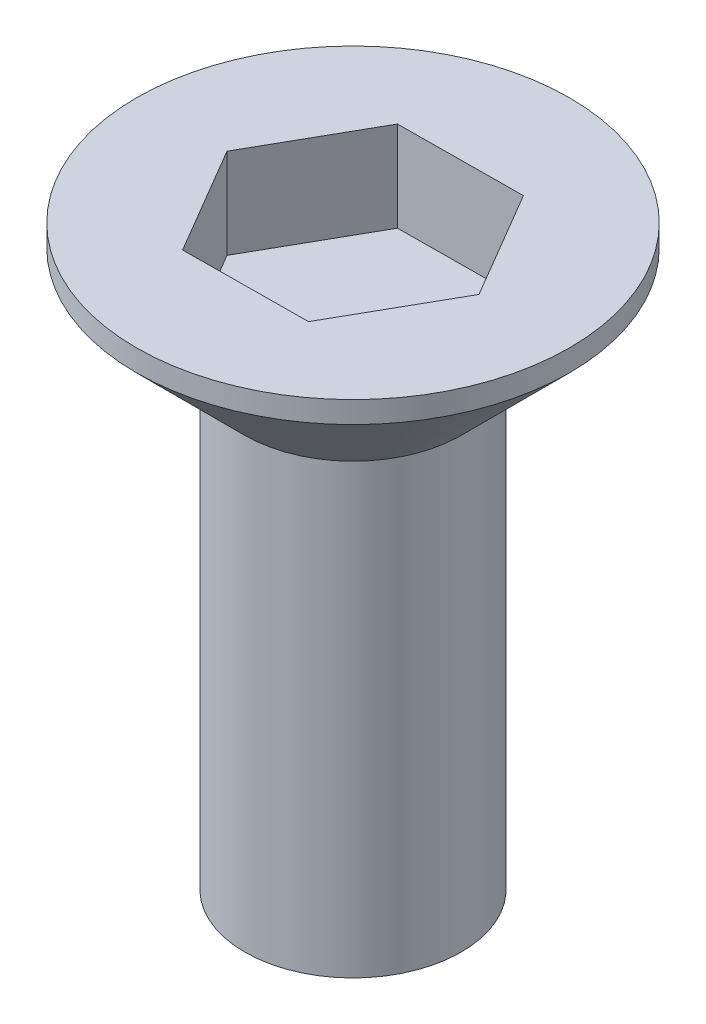
ISO-10303-21;
HEADER;
FILE_DESCRIPTION(('STEP AP214'),'2;1');
FILE_NAME('part.step','',(''),(''),'','','');
FILE_SCHEMA(('AUTOMOTIVE_DESIGN { 1 0 10303 214 1 1 1 1 }'));
ENDSEC;
DATA;
#1=APPLICATION_CONTEXT('core data for automotive mechanical design processes');
#2=APPLICATION_PROTOCOL_DEFINITION('international standard','automotive_design',2000,#1);
#3=PRODUCT_CONTEXT('',#1,'mechanical');
#4=PRODUCT('Part','Part','',(#3));
#5=PRODUCT_RELATED_PRODUCT_CATEGORY('part','',(#4));
#6=PRODUCT_DEFINITION_FORMATION('','',#4);
#7=PRODUCT_DEFINITION_CONTEXT('part definition',#1,'design');
#8=PRODUCT_DEFINITION('design','',#6,#7);
#9=PRODUCT_DEFINITION_SHAPE('','',#8);
#10=(LENGTH_UNIT() NAMED_UNIT(*) SI_UNIT(.MILLI.,.METRE.));
#11=(NAMED_UNIT(*) PLANE_ANGLE_UNIT() SI_UNIT($,.RADIAN.));
#12=(NAMED_UNIT(*) SI_UNIT($,.STERADIAN.) SOLID_ANGLE_UNIT());
#13=UNCERTAINTY_MEASURE_WITH_UNIT(LENGTH_MEASURE(1.E-05),#10,'distance_accuracy_value','');
#14=(GEOMETRIC_REPRESENTATION_CONTEXT(3) GLOBAL_UNCERTAINTY_ASSIGNED_CONTEXT((#13)) GLOBAL_UNIT_ASSIGNED_CONTEXT((#10,
#11,#12)) REPRESENTATION_CONTEXT('',''));
#15=CARTESIAN_POINT('',(0.,0.,0.));
#16=DIRECTION('',(0.,0.,1.));
#17=DIRECTION('',(1.,0.,0.));
#18=AXIS2_PLACEMENT_3D('',#15,#16,#17);
#19=CARTESIAN_POINT('',(0.,0.,0.));
#20=DIRECTION('',(0.,1.,0.));
#21=DIRECTION('',(0.,0.,1.));
#22=AXIS2_PLACEMENT_3D('',#19,#20,#21);
#23=PLANE('',#22);
#24=CARTESIAN_POINT('',(0.,0.,0.));
#25=DIRECTION('',(0.,1.,0.));
#26=DIRECTION('',(0.,0.,1.));
#27=AXIS2_PLACEMENT_3D('',#24,#25,#26);
#28=CIRCLE('',#27,3.);
#29=CARTESIAN_POINT('',(0.,0.,3.));
#30=VERTEX_POINT('',#29);
#31=EDGE_CURVE('E11',#30,#30,#28,.T.);
#32=ORIENTED_EDGE('',*,*,#31,.F.);
#33=EDGE_LOOP('',(#32));
#34=FACE_BOUND('',#33,.T.);
#35=ADVANCED_FACE('F35',(#34),#23,.F.);
#36=CARTESIAN_POINT('',(0.,68.6445759886598,0.));
#37=DIRECTION('',(0.,1.,0.));
#38=DIRECTION('',(0.,0.,1.));
#39=AXIS2_PLACEMENT_3D('',#36,#37,#38);
#40=CYLINDRICAL_SURFACE('',#39,3.);
#41=CARTESIAN_POINT('',(0.,12.4,0.));
#42=DIRECTION('',(0.,1.,0.));
#43=DIRECTION('',(0.,0.,1.));
#44=AXIS2_PLACEMENT_3D('',#41,#42,#43);
#45=CIRCLE('',#44,3.);
#46=CARTESIAN_POINT('',(0.,12.4,3.));
#47=VERTEX_POINT('',#46);
#48=EDGE_CURVE('E42',#47,#47,#45,.T.);
#49=ORIENTED_EDGE('',*,*,#48,.F.);
#50=EDGE_LOOP('',(#49));
#51=FACE_BOUND('',#50,.T.);
#52=ORIENTED_EDGE('',*,*,#31,.T.);
#53=EDGE_LOOP('',(#52));
#54=FACE_BOUND('',#53,.T.);
#55=ADVANCED_FACE('F151',(#51,#54),#40,.T.);
#56=CARTESIAN_POINT('',(0.,12.4,0.));
#57=DIRECTION('',(0.,1.,0.));
#58=DIRECTION('',(0.,0.,1.));
#59=AXIS2_PLACEMENT_3D('',#56,#57,#58);
#60=CONICAL_SURFACE('',#59,3.,0.785398163397446);
#61=CARTESIAN_POINT('',(0.,15.4,0.));
#62=DIRECTION('',(0.,1.,0.));
#63=DIRECTION('',(0.,0.,1.));
#64=AXIS2_PLACEMENT_3D('',#61,#62,#63);
#65=CIRCLE('',#64,6.);
#66=CARTESIAN_POINT('',(0.,15.4,6.));
#67=VERTEX_POINT('',#66);
#68=EDGE_CURVE('E144',#67,#67,#65,.T.);
#69=ORIENTED_EDGE('',*,*,#68,.F.);
#70=EDGE_LOOP('',(#69));
#71=FACE_BOUND('',#70,.T.);
#72=ORIENTED_EDGE('',*,*,#48,.T.);
#73=EDGE_LOOP('',(#72));
#74=FACE_BOUND('',#73,.T.);
#75=ADVANCED_FACE('F149',(#71,#74),#60,.T.);
#76=CARTESIAN_POINT('',(0.,68.6445759886598,0.));
#77=DIRECTION('',(0.,1.,0.));
#78=DIRECTION('',(0.,0.,1.));
#79=AXIS2_PLACEMENT_3D('',#76,#77,#78);
#80=CYLINDRICAL_SURFACE('',#79,6.);
#81=CARTESIAN_POINT('',(0.,16.,0.));
#82=DIRECTION('',(0.,1.,0.));
#83=DIRECTION('',(0.,0.,1.));
#84=AXIS2_PLACEMENT_3D('',#81,#82,#83);
#85=CIRCLE('',#84,6.);
#86=CARTESIAN_POINT('',(0.,16.,6.));
#87=VERTEX_POINT('',#86);
#88=EDGE_CURVE('E136',#87,#87,#85,.T.);
#89=ORIENTED_EDGE('',*,*,#88,.F.);
#90=EDGE_LOOP('',(#89));
#91=FACE_BOUND('',#90,.T.);
#92=ORIENTED_EDGE('',*,*,#68,.T.);
#93=EDGE_LOOP('',(#92));
#94=FACE_BOUND('',#93,.T.);
#95=ADVANCED_FACE('F169',(#91,#94),#80,.T.);
#96=CARTESIAN_POINT('',(6.,16.,0.));
#97=DIRECTION('',(0.,-1.,0.));
#98=DIRECTION('',(0.,0.,-1.));
#99=AXIS2_PLACEMENT_3D('',#96,#97,#98);
#100=PLANE('',#99);
#101=DIRECTION('',(0.493268448593922,0.,-0.869877139383341));
#102=VECTOR('',#101,1.);
#103=CARTESIAN_POINT('',(1.75526540341467,16.,2.98647674753639));
#104=LINE('',#103,#102);
#105=CARTESIAN_POINT('',(1.75526540341467,16.,2.98647674753639));
#106=VERTEX_POINT('',#105);
#107=CARTESIAN_POINT('',(3.46399743288537,16.,-0.0268660559728551));
#108=VERTEX_POINT('',#107);
#109=EDGE_CURVE('E123',#106,#108,#104,.T.);
#110=ORIENTED_EDGE('',*,*,#109,.F.);
#111=DIRECTION('',(0.999969925174272,0.,-0.00775556232399564));
#112=VECTOR('',#111,1.);
#113=CARTESIAN_POINT('',(-1.7087320294707,16.,3.01334280350924));
#114=LINE('',#113,#112);
#115=CARTESIAN_POINT('',(-1.7087320294707,16.,3.01334280350924));
#116=VERTEX_POINT('',#115);
#117=EDGE_CURVE('E49',#116,#106,#114,.T.);
#118=ORIENTED_EDGE('',*,*,#117,.F.);
#119=DIRECTION('',(0.506701476580349,0.,0.862121577059346));
#120=VECTOR('',#119,1.);
#121=CARTESIAN_POINT('',(-3.46399743288537,16.,0.0268660559728533));
#122=LINE('',#121,#120);
#123=CARTESIAN_POINT('',(-3.46399743288537,16.,0.0268660559728533));
#124=VERTEX_POINT('',#123);
#125=EDGE_CURVE('E132',#124,#116,#122,.T.);
#126=ORIENTED_EDGE('',*,*,#125,.F.);
#127=DIRECTION('',(-0.493268448593922,0.,0.869877139383341));
#128=VECTOR('',#127,1.);
#129=CARTESIAN_POINT('',(-1.75526540341467,16.,-2.98647674753639));
#130=LINE('',#129,#128);
#131=CARTESIAN_POINT('',(-1.75526540341467,16.,-2.98647674753639));
#132=VERTEX_POINT('',#131);
#133=EDGE_CURVE('E130',#132,#124,#130,.T.);
#134=ORIENTED_EDGE('',*,*,#133,.F.);
#135=DIRECTION('',(-0.999969925174272,0.,0.0077555623239955));
#136=VECTOR('',#135,1.);
#137=CARTESIAN_POINT('',(1.7087320294707,16.,-3.01334280350924));
#138=LINE('',#137,#136);
#139=CARTESIAN_POINT('',(1.7087320294707,16.,-3.01334280350924));
#140=VERTEX_POINT('',#139);
#141=EDGE_CURVE('E97',#140,#132,#138,.T.);
#142=ORIENTED_EDGE('',*,*,#141,.F.);
#143=DIRECTION('',(-0.506701476580349,0.,-0.862121577059346));
#144=VECTOR('',#143,1.);
#145=CARTESIAN_POINT('',(3.46399743288537,16.,-0.0268660559728551));
#146=LINE('',#145,#144);
#147=EDGE_CURVE('E126',#108,#140,#146,.T.);
#148=ORIENTED_EDGE('',*,*,#147,.F.);
#149=EDGE_LOOP('',(#110,#118,#126,#134,#142,#148));
#150=FACE_BOUND('',#149,.T.);
#151=ORIENTED_EDGE('',*,*,#88,.T.);
#152=EDGE_LOOP('',(#151));
#153=FACE_BOUND('',#152,.T.);
#154=ADVANCED_FACE('F177',(#150,#153),#100,.F.);
#155=CARTESIAN_POINT('',(-1.7087320294707,13.5,3.01334280350924));
#156=DIRECTION('',(0.00775556232399564,0.,0.999969925174272));
#157=DIRECTION('',(0.999969925174272,0.,-0.00775556232399564));
#158=AXIS2_PLACEMENT_3D('',#155,#156,#157);
#159=PLANE('',#158);
#160=ORIENTED_EDGE('',*,*,#117,.T.);
#161=DIRECTION('',(0.,1.,0.));
#162=VECTOR('',#161,1.);
#163=CARTESIAN_POINT('',(1.75526540341467,13.5,2.98647674753639));
#164=LINE('',#163,#162);
#165=CARTESIAN_POINT('',(1.75526540341467,13.5,2.98647674753639));
#166=VERTEX_POINT('',#165);
#167=EDGE_CURVE('E79',#166,#106,#164,.T.);
#168=ORIENTED_EDGE('',*,*,#167,.F.);
#169=DIRECTION('',(0.999969925174272,0.,-0.00775556232399564));
#170=VECTOR('',#169,1.);
#171=CARTESIAN_POINT('',(-1.7087320294707,13.5,3.01334280350924));
#172=LINE('',#171,#170);
#173=CARTESIAN_POINT('',(-1.7087320294707,13.5,3.01334280350924));
#174=VERTEX_POINT('',#173);
#175=EDGE_CURVE('E134',#174,#166,#172,.T.);
#176=ORIENTED_EDGE('',*,*,#175,.F.);
#177=DIRECTION('',(0.,1.,0.));
#178=VECTOR('',#177,1.);
#179=CARTESIAN_POINT('',(-1.7087320294707,13.5,3.01334280350924));
#180=LINE('',#179,#178);
#181=EDGE_CURVE('E57',#174,#116,#180,.T.);
#182=ORIENTED_EDGE('',*,*,#181,.T.);
#183=EDGE_LOOP('',(#160,#168,#176,#182));
#184=FACE_BOUND('',#183,.T.);
#185=ADVANCED_FACE('F185',(#184),#159,.F.);
#186=CARTESIAN_POINT('',(-3.46399743288537,13.5,0.0268660559728533));
#187=DIRECTION('',(-0.862121577059346,0.,0.506701476580349));
#188=DIRECTION('',(0.506701476580349,0.,0.862121577059346));
#189=AXIS2_PLACEMENT_3D('',#186,#187,#188);
#190=PLANE('',#189);
#191=ORIENTED_EDGE('',*,*,#125,.T.);
#192=ORIENTED_EDGE('',*,*,#181,.F.);
#193=DIRECTION('',(0.506701476580349,0.,0.862121577059346));
#194=VECTOR('',#193,1.);
#195=CARTESIAN_POINT('',(-3.46399743288537,13.5,0.0268660559728533));
#196=LINE('',#195,#194);
#197=CARTESIAN_POINT('',(-3.46399743288537,13.5,0.0268660559728533));
#198=VERTEX_POINT('',#197);
#199=EDGE_CURVE('E109',#198,#174,#196,.T.);
#200=ORIENTED_EDGE('',*,*,#199,.F.);
#201=DIRECTION('',(0.,1.,0.));
#202=VECTOR('',#201,1.);
#203=CARTESIAN_POINT('',(-3.46399743288537,13.5,0.0268660559728533));
#204=LINE('',#203,#202);
#205=EDGE_CURVE('E101',#198,#124,#204,.T.);
#206=ORIENTED_EDGE('',*,*,#205,.T.);
#207=EDGE_LOOP('',(#191,#192,#200,#206));
#208=FACE_BOUND('',#207,.T.);
#209=ADVANCED_FACE('F193',(#208),#190,.F.);
#210=CARTESIAN_POINT('',(-1.75526540341467,13.5,-2.98647674753639));
#211=DIRECTION('',(-0.869877139383341,0.,-0.493268448593922));
#212=DIRECTION('',(-0.493268448593922,0.,0.869877139383341));
#213=AXIS2_PLACEMENT_3D('',#210,#211,#212);
#214=PLANE('',#213);
#215=ORIENTED_EDGE('',*,*,#133,.T.);
#216=ORIENTED_EDGE('',*,*,#205,.F.);
#217=DIRECTION('',(-0.493268448593922,0.,0.869877139383341));
#218=VECTOR('',#217,1.);
#219=CARTESIAN_POINT('',(-1.75526540341467,13.5,-2.98647674753639));
#220=LINE('',#219,#218);
#221=CARTESIAN_POINT('',(-1.75526540341467,13.5,-2.98647674753639));
#222=VERTEX_POINT('',#221);
#223=EDGE_CURVE('E105',#222,#198,#220,.T.);
#224=ORIENTED_EDGE('',*,*,#223,.F.);
#225=DIRECTION('',(0.,1.,0.));
#226=VECTOR('',#225,1.);
#227=CARTESIAN_POINT('',(-1.75526540341467,13.5,-2.98647674753639));
#228=LINE('',#227,#226);
#229=EDGE_CURVE('E90',#222,#132,#228,.T.);
#230=ORIENTED_EDGE('',*,*,#229,.T.);
#231=EDGE_LOOP('',(#215,#216,#224,#230));
#232=FACE_BOUND('',#231,.T.);
#233=ADVANCED_FACE('F106',(#232),#214,.F.);
#234=CARTESIAN_POINT('',(1.7087320294707,13.5,-3.01334280350924));
#235=DIRECTION('',(-0.00775556232399551,0.,-0.999969925174272));
#236=DIRECTION('',(-0.999969925174272,0.,0.00775556232399551));
#237=AXIS2_PLACEMENT_3D('',#234,#235,#236);
#238=PLANE('',#237);
#239=ORIENTED_EDGE('',*,*,#141,.T.);
#240=ORIENTED_EDGE('',*,*,#229,.F.);
#241=DIRECTION('',(-0.999969925174272,0.,0.0077555623239955));
#242=VECTOR('',#241,1.);
#243=CARTESIAN_POINT('',(1.7087320294707,13.5,-3.01334280350924));
#244=LINE('',#243,#242);
#245=CARTESIAN_POINT('',(1.7087320294707,13.5,-3.01334280350924));
#246=VERTEX_POINT('',#245);
#247=EDGE_CURVE('E94',#246,#222,#244,.T.);
#248=ORIENTED_EDGE('',*,*,#247,.F.);
#249=DIRECTION('',(0.,1.,0.));
#250=VECTOR('',#249,1.);
#251=CARTESIAN_POINT('',(1.7087320294707,13.5,-3.01334280350924));
#252=LINE('',#251,#250);
#253=EDGE_CURVE('E102',#246,#140,#252,.T.);
#254=ORIENTED_EDGE('',*,*,#253,.T.);
#255=EDGE_LOOP('',(#239,#240,#248,#254));
#256=FACE_BOUND('',#255,.T.);
#257=ADVANCED_FACE('F92',(#256),#238,.F.);
#258=CARTESIAN_POINT('',(3.46399743288537,13.5,-0.0268660559728551));
#259=DIRECTION('',(0.862121577059346,0.,-0.506701476580349));
#260=DIRECTION('',(-0.506701476580349,0.,-0.862121577059346));
#261=AXIS2_PLACEMENT_3D('',#258,#259,#260);
#262=PLANE('',#261);
#263=ORIENTED_EDGE('',*,*,#147,.T.);
#264=ORIENTED_EDGE('',*,*,#253,.F.);
#265=DIRECTION('',(-0.506701476580349,0.,-0.862121577059346));
#266=VECTOR('',#265,1.);
#267=CARTESIAN_POINT('',(3.46399743288537,13.5,-0.0268660559728551));
#268=LINE('',#267,#266);
#269=CARTESIAN_POINT('',(3.46399743288537,13.5,-0.0268660559728551));
#270=VERTEX_POINT('',#269);
#271=EDGE_CURVE('E115',#270,#246,#268,.T.);
#272=ORIENTED_EDGE('',*,*,#271,.F.);
#273=DIRECTION('',(0.,1.,0.));
#274=VECTOR('',#273,1.);
#275=CARTESIAN_POINT('',(3.46399743288537,13.5,-0.0268660559728551));
#276=LINE('',#275,#274);
#277=EDGE_CURVE('E139',#270,#108,#276,.T.);
#278=ORIENTED_EDGE('',*,*,#277,.T.);
#279=EDGE_LOOP('',(#263,#264,#272,#278));
#280=FACE_BOUND('',#279,.T.);
#281=ADVANCED_FACE('F212',(#280),#262,.F.);
#282=CARTESIAN_POINT('',(1.75526540341467,13.5,2.98647674753639));
#283=DIRECTION('',(0.869877139383341,0.,0.493268448593922));
#284=DIRECTION('',(0.493268448593922,0.,-0.869877139383341));
#285=AXIS2_PLACEMENT_3D('',#282,#283,#284);
#286=PLANE('',#285);
#287=ORIENTED_EDGE('',*,*,#109,.T.);
#288=ORIENTED_EDGE('',*,*,#277,.F.);
#289=DIRECTION('',(0.493268448593922,0.,-0.869877139383341));
#290=VECTOR('',#289,1.);
#291=CARTESIAN_POINT('',(1.75526540341467,13.5,2.98647674753639));
#292=LINE('',#291,#290);
#293=EDGE_CURVE('E117',#166,#270,#292,.T.);
#294=ORIENTED_EDGE('',*,*,#293,.F.);
#295=ORIENTED_EDGE('',*,*,#167,.T.);
#296=EDGE_LOOP('',(#287,#288,#294,#295));
#297=FACE_BOUND('',#296,.T.);
#298=ADVANCED_FACE('F219',(#297),#286,.F.);
#299=CARTESIAN_POINT('',(0.,13.5,0.));
#300=DIRECTION('',(0.,1.,0.));
#301=DIRECTION('',(0.,0.,1.));
#302=AXIS2_PLACEMENT_3D('',#299,#300,#301);
#303=PLANE('',#302);
#304=ORIENTED_EDGE('',*,*,#175,.T.);
#305=ORIENTED_EDGE('',*,*,#293,.T.);
#306=ORIENTED_EDGE('',*,*,#271,.T.);
#307=ORIENTED_EDGE('',*,*,#247,.T.);
#308=ORIENTED_EDGE('',*,*,#223,.T.);
#309=ORIENTED_EDGE('',*,*,#199,.T.);
#310=EDGE_LOOP('',(#304,#305,#306,#307,#308,#309));
#311=FACE_BOUND('',#310,.T.);
#312=ADVANCED_FACE('F112',(#311),#303,.T.);
#313=CLOSED_SHELL('',(#35,#55,#75,#95,#154,#185,#209,#233,#257,#281,#298,#312));
#314=MANIFOLD_SOLID_BREP('B2',#313);
#315=ADVANCED_BREP_SHAPE_REPRESENTATION('',(#18,#314),#14);
#316=SHAPE_DEFINITION_REPRESENTATION(#9,#315);
ENDSEC;
END-ISO-10303-21;
